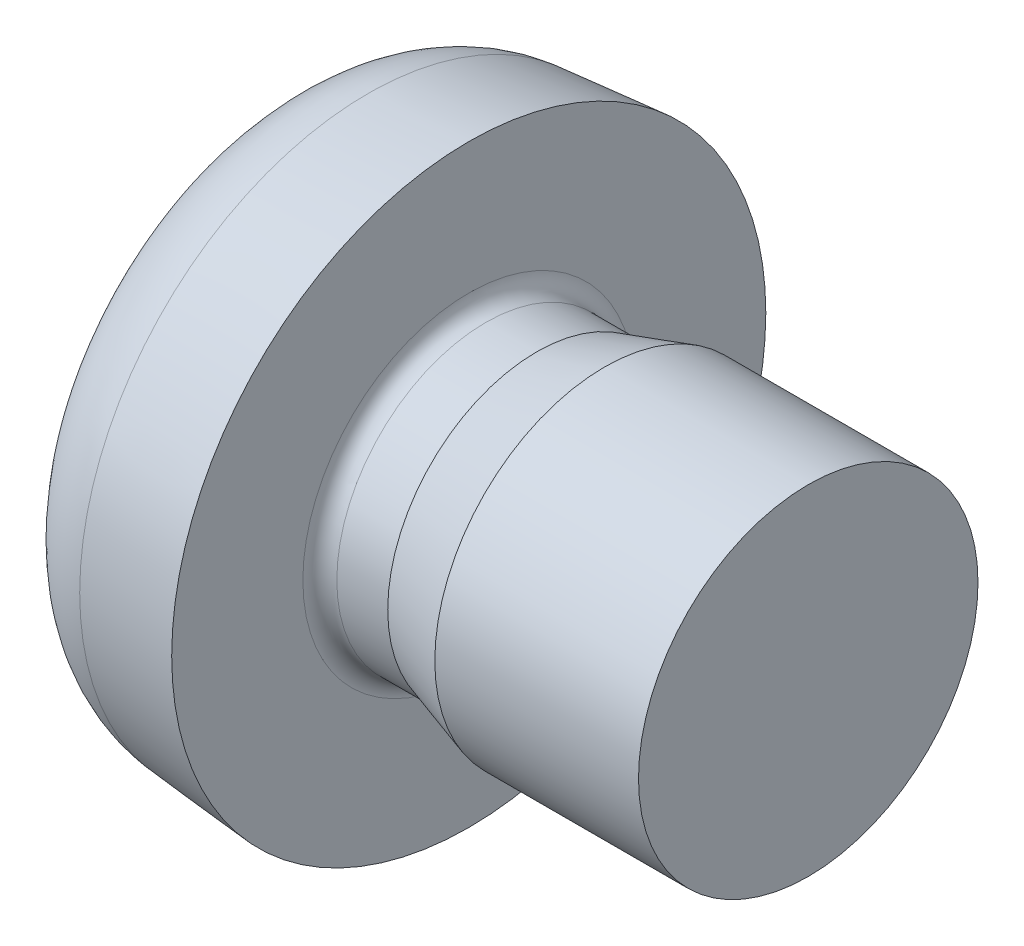
ISO-10303-21;
HEADER;
FILE_DESCRIPTION(('STEP AP214'),'2;1');
FILE_NAME('part.step','',(''),(''),'','','');
FILE_SCHEMA(('AUTOMOTIVE_DESIGN { 1 0 10303 214 1 1 1 1 }'));
ENDSEC;
DATA;
#1=APPLICATION_CONTEXT('core data for automotive mechanical design processes');
#2=APPLICATION_PROTOCOL_DEFINITION('international standard','automotive_design',2000,#1);
#3=PRODUCT_CONTEXT('',#1,'mechanical');
#4=PRODUCT('Part','Part','',(#3));
#5=PRODUCT_RELATED_PRODUCT_CATEGORY('part','',(#4));
#6=PRODUCT_DEFINITION_FORMATION('','',#4);
#7=PRODUCT_DEFINITION_CONTEXT('part definition',#1,'design');
#8=PRODUCT_DEFINITION('design','',#6,#7);
#9=PRODUCT_DEFINITION_SHAPE('','',#8);
#10=(LENGTH_UNIT() NAMED_UNIT(*) SI_UNIT(.MILLI.,.METRE.));
#11=(NAMED_UNIT(*) PLANE_ANGLE_UNIT() SI_UNIT($,.RADIAN.));
#12=(NAMED_UNIT(*) SI_UNIT($,.STERADIAN.) SOLID_ANGLE_UNIT());
#13=UNCERTAINTY_MEASURE_WITH_UNIT(LENGTH_MEASURE(1.E-05),#10,'distance_accuracy_value','');
#14=(GEOMETRIC_REPRESENTATION_CONTEXT(3) GLOBAL_UNCERTAINTY_ASSIGNED_CONTEXT((#13)) GLOBAL_UNIT_ASSIGNED_CONTEXT((#10,
#11,#12)) REPRESENTATION_CONTEXT('',''));
#15=CARTESIAN_POINT('',(0.,0.,0.));
#16=DIRECTION('',(0.,0.,1.));
#17=DIRECTION('',(1.,0.,0.));
#18=AXIS2_PLACEMENT_3D('',#15,#16,#17);
#19=CARTESIAN_POINT('',(3.19999999999697,5.00467722819309E-13,0.));
#20=DIRECTION('',(-1.,0.,0.));
#21=DIRECTION('',(0.,1.,0.));
#22=AXIS2_PLACEMENT_3D('',#19,#20,#21);
#23=SPHERICAL_SURFACE('',#22,4.49999999999697);
#24=CARTESIAN_POINT('',(-1.1171858241993,0.,0.));
#25=DIRECTION('',(-1.,0.,0.));
#26=DIRECTION('',(0.,0.,1.));
#27=AXIS2_PLACEMENT_3D('',#24,#25,#26);
#28=CIRCLE('',#27,1.2696088213827);
#29=CARTESIAN_POINT('',(-1.1171858241993,0.,1.2696088213827));
#30=VERTEX_POINT('',#29);
#31=EDGE_CURVE('E190',#30,#30,#28,.T.);
#32=ORIENTED_EDGE('',*,*,#31,.T.);
#33=EDGE_LOOP('',(#32));
#34=FACE_BOUND('',#33,.T.);
#35=CARTESIAN_POINT('',(3.19999999999697,0.23333333333333,0.));
#36=DIRECTION('',(0.,-1.,0.));
#37=DIRECTION('',(0.,0.,-1.));
#38=AXIS2_PLACEMENT_3D('',#35,#36,#37);
#39=CIRCLE('',#38,4.49394654569105);
#40=CARTESIAN_POINT('',(-1.15724173710329,0.23333333333333,1.1));
#41=VERTEX_POINT('',#40);
#42=CARTESIAN_POINT('',(-1.25592614141861,0.23333333333333,0.58333333333333));
#43=VERTEX_POINT('',#42);
#44=EDGE_CURVE('E11',#41,#43,#39,.T.);
#45=ORIENTED_EDGE('',*,*,#44,.F.);
#46=CARTESIAN_POINT('',(3.19999999999697,5.00467722819309E-13,1.1));
#47=DIRECTION('',(0.,0.,-1.));
#48=DIRECTION('',(-1.,0.,0.));
#49=AXIS2_PLACEMENT_3D('',#46,#47,#48);
#50=CIRCLE('',#49,4.36348484585116);
#51=CARTESIAN_POINT('',(-1.15724173710324,-0.23333333333333,1.1));
#52=VERTEX_POINT('',#51);
#53=EDGE_CURVE('E43',#52,#41,#50,.T.);
#54=ORIENTED_EDGE('',*,*,#53,.F.);
#55=CARTESIAN_POINT('',(3.19999999999697,-0.23333333333333,0.));
#56=DIRECTION('',(0.,1.,0.));
#57=DIRECTION('',(0.,0.,1.));
#58=AXIS2_PLACEMENT_3D('',#55,#56,#57);
#59=CIRCLE('',#58,4.493946545691);
#60=CARTESIAN_POINT('',(-1.25592614141856,-0.23333333333333,0.58333333333333));
#61=VERTEX_POINT('',#60);
#62=EDGE_CURVE('E280',#61,#52,#59,.T.);
#63=ORIENTED_EDGE('',*,*,#62,.F.);
#64=CARTESIAN_POINT('',(-1.25589995149991,-0.58353333333333,0.233333390476192));
#65=CARTESIAN_POINT('',(-1.2584496829755,-0.564084851912746,0.233305072197745));
#66=CARTESIAN_POINT('',(-1.26078445284113,-0.544607407145582,0.234931382302894));
#67=CARTESIAN_POINT('',(-1.26496625073796,-0.506146503499135,0.241398964079554));
#68=CARTESIAN_POINT('',(-1.26681343518266,-0.487162887969295,0.246239202992621));
#69=CARTESIAN_POINT('',(-1.26996529171344,-0.450212688779383,0.259045881137822));
#70=CARTESIAN_POINT('',(-1.27126950205385,-0.432246981919,0.267014970003607));
#71=CARTESIAN_POINT('',(-1.27329407444289,-0.397881531193257,0.285858513724991));
#72=CARTESIAN_POINT('',(-1.27401464252989,-0.381481236508637,0.296731941481725));
#73=CARTESIAN_POINT('',(-1.27484665055323,-0.350862649291144,0.320968649593749));
#74=CARTESIAN_POINT('',(-1.27496356304685,-0.336625892903947,0.334308420734499));
#75=CARTESIAN_POINT('',(-1.27459947008775,-0.310564264718913,0.363163023728163));
#76=CARTESIAN_POINT('',(-1.27411838158194,-0.298739728206596,0.378678157439715));
#77=CARTESIAN_POINT('',(-1.27257602168835,-0.277880461695409,0.411365142703991));
#78=CARTESIAN_POINT('',(-1.27151710548053,-0.268834638240971,0.428530037544093));
#79=CARTESIAN_POINT('',(-1.2688517446949,-0.253710468019218,0.464079307351874));
#80=CARTESIAN_POINT('',(-1.26724547437763,-0.247631178296108,0.48246329270062));
#81=CARTESIAN_POINT('',(-1.26405189501782,-0.239848703553279,0.514692452511942));
#82=CARTESIAN_POINT('',(-1.26258410818833,-0.237398051960483,0.528374369445237));
#83=CARTESIAN_POINT('',(-1.25941320700315,-0.234136171400748,0.555885468612324));
#84=CARTESIAN_POINT('',(-1.2577104299096,-0.233322618458616,0.569714414034388));
#85=CARTESIAN_POINT('',(-1.25589995149995,-0.233333390476192,0.58353333333333));
#86=B_SPLINE_CURVE_WITH_KNOTS('',3,(#64,#65,#66,#67,#68,#69,#70,#71,#72,#73,#74,#75,#76,#77,#78,
#79,#80,#81,#82,#83,#84,#85),.UNSPECIFIED.,.F.,.F.,(4,2,2,2,2,2,2,2,2,2,4),(0.,
0.0587752976278044,0.117531717635116,0.176338002592165,0.235123518594541,0.29337515540582,
0.351634883371351,0.409658903993778,0.467664468805511,0.509501117761438,0.55127833467374),.UNSPECIFIED.);
#87=CARTESIAN_POINT('',(-1.25592614141852,-0.58333333333333,0.23333333333333));
#88=VERTEX_POINT('',#87);
#89=EDGE_CURVE('E274',#88,#61,#86,.T.);
#90=ORIENTED_EDGE('',*,*,#89,.F.);
#91=CARTESIAN_POINT('',(3.19999999999697,5.00467722819309E-13,0.23333333333333));
#92=DIRECTION('',(0.,0.,-1.));
#93=DIRECTION('',(-1.,0.,0.));
#94=AXIS2_PLACEMENT_3D('',#91,#92,#93);
#95=CIRCLE('',#94,4.49394654569103);
#96=CARTESIAN_POINT('',(-1.15724173710314,-1.1,0.23333333333333));
#97=VERTEX_POINT('',#96);
#98=EDGE_CURVE('E281',#97,#88,#95,.T.);
#99=ORIENTED_EDGE('',*,*,#98,.F.);
#100=CARTESIAN_POINT('',(3.19999999999697,-1.1,0.));
#101=DIRECTION('',(0.,1.,0.));
#102=DIRECTION('',(0.,0.,1.));
#103=AXIS2_PLACEMENT_3D('',#100,#101,#102);
#104=CIRCLE('',#103,4.36348484585104);
#105=CARTESIAN_POINT('',(-1.15724173710314,-1.1,-0.23333333333333));
#106=VERTEX_POINT('',#105);
#107=EDGE_CURVE('E340',#106,#97,#104,.T.);
#108=ORIENTED_EDGE('',*,*,#107,.F.);
#109=CARTESIAN_POINT('',(3.19999999999697,5.00467722819309E-13,-0.23333333333333));
#110=DIRECTION('',(0.,0.,1.));
#111=DIRECTION('',(1.,0.,0.));
#112=AXIS2_PLACEMENT_3D('',#109,#110,#111);
#113=CIRCLE('',#112,4.49394654569103);
#114=CARTESIAN_POINT('',(-1.25592614141852,-0.58333333333333,-0.23333333333333));
#115=VERTEX_POINT('',#114);
#116=EDGE_CURVE('E245',#115,#106,#113,.T.);
#117=ORIENTED_EDGE('',*,*,#116,.F.);
#118=CARTESIAN_POINT('',(-1.25589995149995,-0.233333390476192,-0.58353333333333));
#119=CARTESIAN_POINT('',(-1.25844968297554,-0.233305072197745,-0.564084851912747));
#120=CARTESIAN_POINT('',(-1.26078445284116,-0.234931382302894,-0.544607407145583));
#121=CARTESIAN_POINT('',(-1.26496625073799,-0.241398964079553,-0.506146503499136));
#122=CARTESIAN_POINT('',(-1.26681343518268,-0.24623920299262,-0.487162887969297));
#123=CARTESIAN_POINT('',(-1.26996529171346,-0.259045881137821,-0.450212688779386));
#124=CARTESIAN_POINT('',(-1.27126950205387,-0.267014970003605,-0.432246981919004));
#125=CARTESIAN_POINT('',(-1.2732940744429,-0.285858513724989,-0.397881531193261));
#126=CARTESIAN_POINT('',(-1.2740146425299,-0.296731941481722,-0.381481236508641));
#127=CARTESIAN_POINT('',(-1.27484665055324,-0.320968649593745,-0.350862649291149));
#128=CARTESIAN_POINT('',(-1.27496356304685,-0.334308420734494,-0.336625892903952));
#129=CARTESIAN_POINT('',(-1.27459947008774,-0.363163023728157,-0.310564264718918));
#130=CARTESIAN_POINT('',(-1.27411838158193,-0.378678157439708,-0.298739728206601));
#131=CARTESIAN_POINT('',(-1.27257602168833,-0.411365142703983,-0.277880461695414));
#132=CARTESIAN_POINT('',(-1.27151710548051,-0.428530037544085,-0.268834638240975));
#133=CARTESIAN_POINT('',(-1.26885174469488,-0.464079307351865,-0.253710468019221));
#134=CARTESIAN_POINT('',(-1.2672454743776,-0.482463292700611,-0.247631178296111));
#135=CARTESIAN_POINT('',(-1.26405189501779,-0.514692452511934,-0.239848703553281));
#136=CARTESIAN_POINT('',(-1.2625841081883,-0.528374369445231,-0.237398051960483));
#137=CARTESIAN_POINT('',(-1.25941320700312,-0.555885468612321,-0.234136171400748));
#138=CARTESIAN_POINT('',(-1.25771042990956,-0.569714414034387,-0.233322618458616));
#139=CARTESIAN_POINT('',(-1.25589995149991,-0.58353333333333,-0.233333390476192));
#140=B_SPLINE_CURVE_WITH_KNOTS('',3,(#118,#119,#120,#121,#122,#123,#124,#125,#126,#127,#128,
#129,#130,#131,#132,#133,#134,#135,#136,#137,#138,#139),.UNSPECIFIED.,.F.,.F.,(4,2,2,2,2,2,2,2,
2,2,4),(0.,0.0587752976278023,0.117531717635112,0.176338002592159,0.235123518594533,
0.293375155405811,0.35163488337134,0.409658903993767,0.4676644688055,0.509501117761433,
0.55127833467374),.UNSPECIFIED.);
#141=CARTESIAN_POINT('',(-1.25592614141856,-0.23333333333333,-0.58333333333333));
#142=VERTEX_POINT('',#141);
#143=EDGE_CURVE('E239',#142,#115,#140,.T.);
#144=ORIENTED_EDGE('',*,*,#143,.F.);
#145=CARTESIAN_POINT('',(3.19999999999697,-0.23333333333333,0.));
#146=DIRECTION('',(0.,1.,0.));
#147=DIRECTION('',(0.,0.,1.));
#148=AXIS2_PLACEMENT_3D('',#145,#146,#147);
#149=CIRCLE('',#148,4.493946545691);
#150=CARTESIAN_POINT('',(-1.15724173710324,-0.23333333333333,-1.1));
#151=VERTEX_POINT('',#150);
#152=EDGE_CURVE('E237',#151,#142,#149,.T.);
#153=ORIENTED_EDGE('',*,*,#152,.F.);
#154=CARTESIAN_POINT('',(3.19999999999697,5.00467722819309E-13,-1.1));
#155=DIRECTION('',(0.,0.,1.));
#156=DIRECTION('',(1.,0.,0.));
#157=AXIS2_PLACEMENT_3D('',#154,#155,#156);
#158=CIRCLE('',#157,4.36348484585116);
#159=CARTESIAN_POINT('',(-1.15724173710329,0.23333333333333,-1.1));
#160=VERTEX_POINT('',#159);
#161=EDGE_CURVE('E235',#160,#151,#158,.T.);
#162=ORIENTED_EDGE('',*,*,#161,.F.);
#163=CARTESIAN_POINT('',(3.19999999999697,0.23333333333333,0.));
#164=DIRECTION('',(0.,-1.,0.));
#165=DIRECTION('',(0.,0.,-1.));
#166=AXIS2_PLACEMENT_3D('',#163,#164,#165);
#167=CIRCLE('',#166,4.49394654569105);
#168=CARTESIAN_POINT('',(-1.25592614141861,0.23333333333333,-0.58333333333333));
#169=VERTEX_POINT('',#168);
#170=EDGE_CURVE('E232',#169,#160,#167,.T.);
#171=ORIENTED_EDGE('',*,*,#170,.F.);
#172=CARTESIAN_POINT('',(-1.25589995150004,0.58353333333333,-0.233333390476192));
#173=CARTESIAN_POINT('',(-1.25844968297562,0.564084851912746,-0.233305072197745));
#174=CARTESIAN_POINT('',(-1.26078445284125,0.544607407145582,-0.234931382302894));
#175=CARTESIAN_POINT('',(-1.26496625073808,0.506146503499135,-0.241398964079554));
#176=CARTESIAN_POINT('',(-1.26681343518277,0.487162887969296,-0.246239202992621));
#177=CARTESIAN_POINT('',(-1.26996529171354,0.450212688779385,-0.259045881137821));
#178=CARTESIAN_POINT('',(-1.27126950205395,0.432246981919002,-0.267014970003606));
#179=CARTESIAN_POINT('',(-1.27329407444297,0.397881531193259,-0.28585851372499));
#180=CARTESIAN_POINT('',(-1.27401464252997,0.381481236508639,-0.296731941481723));
#181=CARTESIAN_POINT('',(-1.27484665055331,0.350862649291147,-0.320968649593747));
#182=CARTESIAN_POINT('',(-1.27496356304693,0.33662589290395,-0.334308420734496));
#183=CARTESIAN_POINT('',(-1.27459947008782,0.310564264718915,-0.36316302372816));
#184=CARTESIAN_POINT('',(-1.27411838158201,0.298739728206598,-0.378678157439712));
#185=CARTESIAN_POINT('',(-1.27257602168841,0.277880461695411,-0.411365142703988));
#186=CARTESIAN_POINT('',(-1.27151710548059,0.268834638240972,-0.42853003754409));
#187=CARTESIAN_POINT('',(-1.26885174469496,0.253710468019218,-0.464079307351872));
#188=CARTESIAN_POINT('',(-1.26724547437768,0.247631178296108,-0.482463292700618));
#189=CARTESIAN_POINT('',(-1.26405189501787,0.239848703553279,-0.514692452511941));
#190=CARTESIAN_POINT('',(-1.26258410818838,0.237398051960483,-0.528374369445236));
#191=CARTESIAN_POINT('',(-1.2594132070032,0.234136171400748,-0.555885468612324));
#192=CARTESIAN_POINT('',(-1.25771042990965,0.233322618458616,-0.569714414034388));
#193=CARTESIAN_POINT('',(-1.2558999515,0.233333390476192,-0.58353333333333));
#194=B_SPLINE_CURVE_WITH_KNOTS('',3,(#172,#173,#174,#175,#176,#177,#178,#179,#180,#181,#182,
#183,#184,#185,#186,#187,#188,#189,#190,#191,#192,#193),.UNSPECIFIED.,.F.,.F.,(4,2,2,2,2,2,2,2,
2,2,4),(0.,0.0587752976278027,0.117531717635112,0.17633800259216,0.235123518594534,
0.293375155405813,0.351634883371344,0.409658903993772,0.467664468805507,0.509501117761435,
0.551278334673738),.UNSPECIFIED.);
#195=CARTESIAN_POINT('',(-1.25592614141865,0.58333333333333,-0.23333333333333));
#196=VERTEX_POINT('',#195);
#197=EDGE_CURVE('E226',#196,#169,#194,.T.);
#198=ORIENTED_EDGE('',*,*,#197,.F.);
#199=CARTESIAN_POINT('',(3.19999999999697,5.00467722819309E-13,-0.23333333333333));
#200=DIRECTION('',(0.,0.,1.));
#201=DIRECTION('',(1.,0.,0.));
#202=AXIS2_PLACEMENT_3D('',#199,#200,#201);
#203=CIRCLE('',#202,4.49394654569103);
#204=CARTESIAN_POINT('',(-1.15724173710339,1.1,-0.23333333333333));
#205=VERTEX_POINT('',#204);
#206=EDGE_CURVE('E233',#205,#196,#203,.T.);
#207=ORIENTED_EDGE('',*,*,#206,.F.);
#208=CARTESIAN_POINT('',(3.19999999999697,1.1,0.));
#209=DIRECTION('',(0.,-1.,0.));
#210=DIRECTION('',(0.,0.,-1.));
#211=AXIS2_PLACEMENT_3D('',#208,#209,#210);
#212=CIRCLE('',#211,4.36348484585129);
#213=CARTESIAN_POINT('',(-1.15724173710339,1.1,0.23333333333333));
#214=VERTEX_POINT('',#213);
#215=EDGE_CURVE('E373',#214,#205,#212,.T.);
#216=ORIENTED_EDGE('',*,*,#215,.F.);
#217=CARTESIAN_POINT('',(3.19999999999697,5.00467722819309E-13,0.23333333333333));
#218=DIRECTION('',(0.,0.,-1.));
#219=DIRECTION('',(-1.,0.,0.));
#220=AXIS2_PLACEMENT_3D('',#217,#218,#219);
#221=CIRCLE('',#220,4.49394654569103);
#222=CARTESIAN_POINT('',(-1.25592614141865,0.58333333333333,0.23333333333333));
#223=VERTEX_POINT('',#222);
#224=EDGE_CURVE('E199',#223,#214,#221,.T.);
#225=ORIENTED_EDGE('',*,*,#224,.F.);
#226=CARTESIAN_POINT('',(-1.25589995150001,0.233333390476192,0.58353333333333));
#227=CARTESIAN_POINT('',(-1.25844968297559,0.233305072197745,0.564084851912746));
#228=CARTESIAN_POINT('',(-1.26078445284122,0.234931382302894,0.544607407145582));
#229=CARTESIAN_POINT('',(-1.26496625073805,0.241398964079554,0.506146503499134));
#230=CARTESIAN_POINT('',(-1.26681343518274,0.246239202992621,0.487162887969294));
#231=CARTESIAN_POINT('',(-1.26996529171352,0.259045881137823,0.450212688779382));
#232=CARTESIAN_POINT('',(-1.27126950205393,0.267014970003608,0.432246981918999));
#233=CARTESIAN_POINT('',(-1.27329407444296,0.285858513724992,0.397881531193255));
#234=CARTESIAN_POINT('',(-1.27401464252996,0.296731941481726,0.381481236508634));
#235=CARTESIAN_POINT('',(-1.27484665055331,0.320968649593751,0.350862649291142));
#236=CARTESIAN_POINT('',(-1.27496356304693,0.334308420734501,0.336625892903945));
#237=CARTESIAN_POINT('',(-1.27459947008782,0.363163023728167,0.31056426471891));
#238=CARTESIAN_POINT('',(-1.27411838158202,0.378678157439718,0.298739728206593));
#239=CARTESIAN_POINT('',(-1.27257602168843,0.411365142703996,0.277880461695407));
#240=CARTESIAN_POINT('',(-1.2715171054806,0.428530037544098,0.268834638240968));
#241=CARTESIAN_POINT('',(-1.26885174469498,0.464079307351881,0.253710468019215));
#242=CARTESIAN_POINT('',(-1.26724547437771,0.482463292700628,0.247631178296106));
#243=CARTESIAN_POINT('',(-1.2640518950179,0.51469245251195,0.239848703553278));
#244=CARTESIAN_POINT('',(-1.26258410818841,0.528374369445243,0.237398051960482));
#245=CARTESIAN_POINT('',(-1.25941320700324,0.555885468612327,0.234136171400748));
#246=CARTESIAN_POINT('',(-1.25771042990969,0.569714414034389,0.233322618458616));
#247=CARTESIAN_POINT('',(-1.25589995150004,0.58353333333333,0.233333390476192));
#248=B_SPLINE_CURVE_WITH_KNOTS('',3,(#226,#227,#228,#229,#230,#231,#232,#233,#234,#235,#236,
#237,#238,#239,#240,#241,#242,#243,#244,#245,#246,#247),.UNSPECIFIED.,.F.,.F.,(4,2,2,2,2,2,2,2,
2,2,4),(0.,0.0587752976278047,0.117531717635117,0.176338002592166,0.235123518594543,
0.293375155405823,0.351634883371355,0.409658903993783,0.467664468805518,0.50950111776144,
0.551278334673738),.UNSPECIFIED.);
#249=EDGE_CURVE('E193',#43,#223,#248,.T.);
#250=ORIENTED_EDGE('',*,*,#249,.F.);
#251=EDGE_LOOP('',(#45,#54,#63,#90,#99,#108,#117,#144,#153,#162,#171,#198,#207,#216,#225,#250));
#252=FACE_BOUND('',#251,.T.);
#253=ADVANCED_FACE('F35',(#34,#252),#23,.T.);
#254=CARTESIAN_POINT('',(-0.541561047639258,0.,0.));
#255=DIRECTION('',(-1.,0.,0.));
#256=DIRECTION('',(0.,0.,1.));
#257=AXIS2_PLACEMENT_3D('',#254,#255,#256);
#258=TOROIDAL_SURFACE('',#257,1.10032764519819,0.600000000000175);
#259=ORIENTED_EDGE('',*,*,#31,.F.);
#260=EDGE_LOOP('',(#259));
#261=FACE_BOUND('',#260,.T.);
#262=CARTESIAN_POINT('',(-0.59385449328798,0.,0.));
#263=DIRECTION('',(-1.,0.,0.));
#264=DIRECTION('',(0.,0.,1.));
#265=AXIS2_PLACEMENT_3D('',#262,#263,#264);
#266=CIRCLE('',#265,1.6980444640534);
#267=CARTESIAN_POINT('',(-0.59385449328798,0.,1.6980444640534));
#268=VERTEX_POINT('',#267);
#269=EDGE_CURVE('E187',#268,#268,#266,.T.);
#270=ORIENTED_EDGE('',*,*,#269,.T.);
#271=EDGE_LOOP('',(#270));
#272=FACE_BOUND('',#271,.T.);
#273=ADVANCED_FACE('F397',(#261,#272),#258,.T.);
#274=CARTESIAN_POINT('',(0.,0.,0.));
#275=DIRECTION('',(1.,0.,0.));
#276=DIRECTION('',(0.,0.,-1.));
#277=AXIS2_PLACEMENT_3D('',#274,#275,#276);
#278=CONICAL_SURFACE('',#277,1.75,0.0872664625996661);
#279=ORIENTED_EDGE('',*,*,#269,.F.);
#280=EDGE_LOOP('',(#279));
#281=FACE_BOUND('',#280,.T.);
#282=CARTESIAN_POINT('',(0.,0.,0.));
#283=DIRECTION('',(-1.,0.,0.));
#284=DIRECTION('',(0.,0.,1.));
#285=AXIS2_PLACEMENT_3D('',#282,#283,#284);
#286=CIRCLE('',#285,1.75);
#287=CARTESIAN_POINT('',(0.,0.,1.75));
#288=VERTEX_POINT('',#287);
#289=EDGE_CURVE('E184',#288,#288,#286,.T.);
#290=ORIENTED_EDGE('',*,*,#289,.T.);
#291=EDGE_LOOP('',(#290));
#292=FACE_BOUND('',#291,.T.);
#293=ADVANCED_FACE('F402',(#281,#292),#278,.T.);
#294=CARTESIAN_POINT('',(0.,1.75,0.));
#295=DIRECTION('',(-1.,0.,0.));
#296=DIRECTION('',(0.,0.,1.));
#297=AXIS2_PLACEMENT_3D('',#294,#295,#296);
#298=PLANE('',#297);
#299=ORIENTED_EDGE('',*,*,#289,.F.);
#300=EDGE_LOOP('',(#299));
#301=FACE_BOUND('',#300,.T.);
#302=CARTESIAN_POINT('',(0.,0.,0.));
#303=DIRECTION('',(-1.,0.,0.));
#304=DIRECTION('',(0.,0.,1.));
#305=AXIS2_PLACEMENT_3D('',#302,#303,#304);
#306=CIRCLE('',#305,0.97725000000002);
#307=CARTESIAN_POINT('',(0.,0.,0.97725000000002));
#308=VERTEX_POINT('',#307);
#309=EDGE_CURVE('E181',#308,#308,#306,.T.);
#310=ORIENTED_EDGE('',*,*,#309,.T.);
#311=EDGE_LOOP('',(#310));
#312=FACE_BOUND('',#311,.T.);
#313=ADVANCED_FACE('F410',(#301,#312),#298,.F.);
#314=CARTESIAN_POINT('',(0.0999999999999906,0.,0.));
#315=DIRECTION('',(-1.,0.,0.));
#316=DIRECTION('',(0.,0.,1.));
#317=AXIS2_PLACEMENT_3D('',#314,#315,#316);
#318=TOROIDAL_SURFACE('',#317,0.977250000000011,0.0999999999999906);
#319=ORIENTED_EDGE('',*,*,#309,.F.);
#320=EDGE_LOOP('',(#319));
#321=FACE_BOUND('',#320,.T.);
#322=CARTESIAN_POINT('',(0.0999999999999981,0.,0.));
#323=DIRECTION('',(-1.,0.,0.));
#324=DIRECTION('',(0.,0.,1.));
#325=AXIS2_PLACEMENT_3D('',#322,#323,#324);
#326=CIRCLE('',#325,0.87725000000002);
#327=CARTESIAN_POINT('',(0.0999999999999981,0.,0.87725000000002));
#328=VERTEX_POINT('',#327);
#329=EDGE_CURVE('E178',#328,#328,#326,.T.);
#330=ORIENTED_EDGE('',*,*,#329,.T.);
#331=EDGE_LOOP('',(#330));
#332=FACE_BOUND('',#331,.T.);
#333=ADVANCED_FACE('F416',(#321,#332),#318,.F.);
#334=CARTESIAN_POINT('',(2.,0.,0.));
#335=DIRECTION('',(-1.,0.,0.));
#336=DIRECTION('',(0.,0.,1.));
#337=AXIS2_PLACEMENT_3D('',#334,#335,#336);
#338=CYLINDRICAL_SURFACE('',#337,0.877250000000015);
#339=ORIENTED_EDGE('',*,*,#329,.F.);
#340=EDGE_LOOP('',(#339));
#341=FACE_BOUND('',#340,.T.);
#342=CARTESIAN_POINT('',(0.40000000000002,0.,0.));
#343=DIRECTION('',(-1.,0.,0.));
#344=DIRECTION('',(0.,0.,1.));
#345=AXIS2_PLACEMENT_3D('',#342,#343,#344);
#346=CIRCLE('',#345,0.87725000000001);
#347=CARTESIAN_POINT('',(0.40000000000002,0.,0.87725000000001));
#348=VERTEX_POINT('',#347);
#349=EDGE_CURVE('E175',#348,#348,#346,.T.);
#350=ORIENTED_EDGE('',*,*,#349,.T.);
#351=EDGE_LOOP('',(#350));
#352=FACE_BOUND('',#351,.T.);
#353=ADVANCED_FACE('F422',(#341,#352),#338,.T.);
#354=CARTESIAN_POINT('',(0.8,0.,0.));
#355=DIRECTION('',(1.,0.,0.));
#356=DIRECTION('',(0.,0.,-1.));
#357=AXIS2_PLACEMENT_3D('',#354,#355,#356);
#358=CONICAL_SURFACE('',#357,1.,0.297752138542782);
#359=ORIENTED_EDGE('',*,*,#349,.F.);
#360=EDGE_LOOP('',(#359));
#361=FACE_BOUND('',#360,.T.);
#362=CARTESIAN_POINT('',(0.8,0.,0.));
#363=DIRECTION('',(-1.,0.,0.));
#364=DIRECTION('',(0.,0.,1.));
#365=AXIS2_PLACEMENT_3D('',#362,#363,#364);
#366=CIRCLE('',#365,1.);
#367=CARTESIAN_POINT('',(0.8,0.,1.));
#368=VERTEX_POINT('',#367);
#369=EDGE_CURVE('E167',#368,#368,#366,.T.);
#370=ORIENTED_EDGE('',*,*,#369,.T.);
#371=EDGE_LOOP('',(#370));
#372=FACE_BOUND('',#371,.T.);
#373=ADVANCED_FACE('F428',(#361,#372),#358,.T.);
#374=CARTESIAN_POINT('',(2.,0.,0.));
#375=DIRECTION('',(-1.,0.,0.));
#376=DIRECTION('',(0.,0.,1.));
#377=AXIS2_PLACEMENT_3D('',#374,#375,#376);
#378=CYLINDRICAL_SURFACE('',#377,1.);
#379=ORIENTED_EDGE('',*,*,#369,.F.);
#380=EDGE_LOOP('',(#379));
#381=FACE_BOUND('',#380,.T.);
#382=CARTESIAN_POINT('',(2.,0.,0.));
#383=DIRECTION('',(-1.,0.,0.));
#384=DIRECTION('',(0.,0.,1.));
#385=AXIS2_PLACEMENT_3D('',#382,#383,#384);
#386=CIRCLE('',#385,1.);
#387=CARTESIAN_POINT('',(2.,0.,1.));
#388=VERTEX_POINT('',#387);
#389=EDGE_CURVE('E163',#388,#388,#386,.T.);
#390=ORIENTED_EDGE('',*,*,#389,.T.);
#391=EDGE_LOOP('',(#390));
#392=FACE_BOUND('',#391,.T.);
#393=ADVANCED_FACE('F434',(#381,#392),#378,.T.);
#394=CARTESIAN_POINT('',(2.,1.,0.));
#395=DIRECTION('',(-1.,0.,0.));
#396=DIRECTION('',(0.,0.,1.));
#397=AXIS2_PLACEMENT_3D('',#394,#395,#396);
#398=PLANE('',#397);
#399=ORIENTED_EDGE('',*,*,#389,.F.);
#400=EDGE_LOOP('',(#399));
#401=FACE_BOUND('',#400,.T.);
#402=ADVANCED_FACE('F440',(#401),#398,.F.);
#403=CARTESIAN_POINT('',(-0.65,0.23333333333333,0.58333333333333));
#404=DIRECTION('',(0.,-1.,0.));
#405=DIRECTION('',(0.,0.,-1.));
#406=AXIS2_PLACEMENT_3D('',#403,#404,#405);
#407=PLANE('',#406);
#408=ORIENTED_EDGE('',*,*,#44,.T.);
#409=DIRECTION('',(-1.,0.,0.));
#410=VECTOR('',#409,1.);
#411=CARTESIAN_POINT('',(-0.65,0.23333333333333,0.58333333333333));
#412=LINE('',#411,#410);
#413=CARTESIAN_POINT('',(-0.65,0.23333333333333,0.58333333333333));
#414=VERTEX_POINT('',#413);
#415=EDGE_CURVE('E50',#414,#43,#412,.T.);
#416=ORIENTED_EDGE('',*,*,#415,.F.);
#417=DIRECTION('',(0.,0.,1.));
#418=VECTOR('',#417,1.);
#419=CARTESIAN_POINT('',(-0.65,0.23333333333333,0.58333333333333));
#420=LINE('',#419,#418);
#421=CARTESIAN_POINT('',(-0.65,0.23333333333333,1.1));
#422=VERTEX_POINT('',#421);
#423=EDGE_CURVE('E152',#414,#422,#420,.T.);
#424=ORIENTED_EDGE('',*,*,#423,.T.);
#425=DIRECTION('',(-1.,0.,0.));
#426=VECTOR('',#425,1.);
#427=CARTESIAN_POINT('',(-0.65,0.23333333333333,1.1));
#428=LINE('',#427,#426);
#429=EDGE_CURVE('E159',#422,#41,#428,.T.);
#430=ORIENTED_EDGE('',*,*,#429,.T.);
#431=EDGE_LOOP('',(#408,#416,#424,#430));
#432=FACE_BOUND('',#431,.T.);
#433=ADVANCED_FACE('F158',(#432),#407,.T.);
#434=CARTESIAN_POINT('',(-0.65,0.23333333333333,1.1));
#435=DIRECTION('',(0.,0.,-1.));
#436=DIRECTION('',(-1.,0.,0.));
#437=AXIS2_PLACEMENT_3D('',#434,#435,#436);
#438=PLANE('',#437);
#439=ORIENTED_EDGE('',*,*,#53,.T.);
#440=ORIENTED_EDGE('',*,*,#429,.F.);
#441=DIRECTION('',(0.,-1.,0.));
#442=VECTOR('',#441,1.);
#443=CARTESIAN_POINT('',(-0.65,0.23333333333333,1.1));
#444=LINE('',#443,#442);
#445=CARTESIAN_POINT('',(-0.65,-0.23333333333333,1.1));
#446=VERTEX_POINT('',#445);
#447=EDGE_CURVE('E148',#422,#446,#444,.T.);
#448=ORIENTED_EDGE('',*,*,#447,.T.);
#449=DIRECTION('',(-1.,0.,0.));
#450=VECTOR('',#449,1.);
#451=CARTESIAN_POINT('',(-0.65,-0.23333333333333,1.1));
#452=LINE('',#451,#450);
#453=EDGE_CURVE('E164',#446,#52,#452,.T.);
#454=ORIENTED_EDGE('',*,*,#453,.T.);
#455=EDGE_LOOP('',(#439,#440,#448,#454));
#456=FACE_BOUND('',#455,.T.);
#457=ADVANCED_FACE('F162',(#456),#438,.T.);
#458=CARTESIAN_POINT('',(-0.65,-0.23333333333333,1.1));
#459=DIRECTION('',(0.,1.,0.));
#460=DIRECTION('',(0.,0.,1.));
#461=AXIS2_PLACEMENT_3D('',#458,#459,#460);
#462=PLANE('',#461);
#463=ORIENTED_EDGE('',*,*,#62,.T.);
#464=ORIENTED_EDGE('',*,*,#453,.F.);
#465=DIRECTION('',(0.,0.,-1.));
#466=VECTOR('',#465,1.);
#467=CARTESIAN_POINT('',(-0.65,-0.23333333333333,1.1));
#468=LINE('',#467,#466);
#469=CARTESIAN_POINT('',(-0.65,-0.23333333333333,0.58333333333333));
#470=VERTEX_POINT('',#469);
#471=EDGE_CURVE('E154',#446,#470,#468,.T.);
#472=ORIENTED_EDGE('',*,*,#471,.T.);
#473=DIRECTION('',(-1.,0.,0.));
#474=VECTOR('',#473,1.);
#475=CARTESIAN_POINT('',(-0.65,-0.23333333333333,0.58333333333333));
#476=LINE('',#475,#474);
#477=EDGE_CURVE('E169',#470,#61,#476,.T.);
#478=ORIENTED_EDGE('',*,*,#477,.T.);
#479=EDGE_LOOP('',(#463,#464,#472,#478));
#480=FACE_BOUND('',#479,.T.);
#481=ADVANCED_FACE('F270',(#480),#462,.T.);
#482=CARTESIAN_POINT('',(-0.65,-0.583333333333336,0.583333333333336));
#483=DIRECTION('',(-1.,0.,0.));
#484=DIRECTION('',(0.,0.,1.));
#485=AXIS2_PLACEMENT_3D('',#482,#483,#484);
#486=CYLINDRICAL_SURFACE('',#485,0.350000000000006);
#487=ORIENTED_EDGE('',*,*,#89,.T.);
#488=ORIENTED_EDGE('',*,*,#477,.F.);
#489=CARTESIAN_POINT('',(-0.65,-0.583333333333336,0.583333333333336));
#490=DIRECTION('',(-1.,0.,0.));
#491=DIRECTION('',(0.,0.,1.));
#492=AXIS2_PLACEMENT_3D('',#489,#490,#491);
#493=CIRCLE('',#492,0.350000000000006);
#494=CARTESIAN_POINT('',(-0.65,-0.58333333333333,0.23333333333333));
#495=VERTEX_POINT('',#494);
#496=EDGE_CURVE('E335',#470,#495,#493,.T.);
#497=ORIENTED_EDGE('',*,*,#496,.T.);
#498=DIRECTION('',(-1.,0.,0.));
#499=VECTOR('',#498,1.);
#500=CARTESIAN_POINT('',(-0.65,-0.58333333333333,0.23333333333333));
#501=LINE('',#500,#499);
#502=EDGE_CURVE('E332',#495,#88,#501,.T.);
#503=ORIENTED_EDGE('',*,*,#502,.T.);
#504=EDGE_LOOP('',(#487,#488,#497,#503));
#505=FACE_BOUND('',#504,.T.);
#506=ADVANCED_FACE('F265',(#505),#486,.T.);
#507=CARTESIAN_POINT('',(-0.65,-0.58333333333333,0.23333333333333));
#508=DIRECTION('',(0.,0.,-1.));
#509=DIRECTION('',(-1.,0.,0.));
#510=AXIS2_PLACEMENT_3D('',#507,#508,#509);
#511=PLANE('',#510);
#512=ORIENTED_EDGE('',*,*,#98,.T.);
#513=ORIENTED_EDGE('',*,*,#502,.F.);
#514=DIRECTION('',(0.,-1.,0.));
#515=VECTOR('',#514,1.);
#516=CARTESIAN_POINT('',(-0.65,-0.58333333333333,0.23333333333333));
#517=LINE('',#516,#515);
#518=CARTESIAN_POINT('',(-0.65,-1.1,0.23333333333333));
#519=VERTEX_POINT('',#518);
#520=EDGE_CURVE('E349',#495,#519,#517,.T.);
#521=ORIENTED_EDGE('',*,*,#520,.T.);
#522=DIRECTION('',(-1.,0.,0.));
#523=VECTOR('',#522,1.);
#524=CARTESIAN_POINT('',(-0.65,-1.1,0.23333333333333));
#525=LINE('',#524,#523);
#526=EDGE_CURVE('E329',#519,#97,#525,.T.);
#527=ORIENTED_EDGE('',*,*,#526,.T.);
#528=EDGE_LOOP('',(#512,#513,#521,#527));
#529=FACE_BOUND('',#528,.T.);
#530=ADVANCED_FACE('F261',(#529),#511,.T.);
#531=CARTESIAN_POINT('',(-0.65,-1.1,0.23333333333333));
#532=DIRECTION('',(0.,1.,0.));
#533=DIRECTION('',(0.,0.,1.));
#534=AXIS2_PLACEMENT_3D('',#531,#532,#533);
#535=PLANE('',#534);
#536=ORIENTED_EDGE('',*,*,#107,.T.);
#537=ORIENTED_EDGE('',*,*,#526,.F.);
#538=DIRECTION('',(0.,0.,-1.));
#539=VECTOR('',#538,1.);
#540=CARTESIAN_POINT('',(-0.65,-1.1,0.23333333333333));
#541=LINE('',#540,#539);
#542=CARTESIAN_POINT('',(-0.65,-1.1,-0.23333333333333));
#543=VERTEX_POINT('',#542);
#544=EDGE_CURVE('E347',#519,#543,#541,.T.);
#545=ORIENTED_EDGE('',*,*,#544,.T.);
#546=DIRECTION('',(-1.,0.,0.));
#547=VECTOR('',#546,1.);
#548=CARTESIAN_POINT('',(-0.65,-1.1,-0.23333333333333));
#549=LINE('',#548,#547);
#550=EDGE_CURVE('E326',#543,#106,#549,.T.);
#551=ORIENTED_EDGE('',*,*,#550,.T.);
#552=EDGE_LOOP('',(#536,#537,#545,#551));
#553=FACE_BOUND('',#552,.T.);
#554=ADVANCED_FACE('F257',(#553),#535,.T.);
#555=CARTESIAN_POINT('',(-0.65,-1.1,-0.23333333333333));
#556=DIRECTION('',(0.,0.,1.));
#557=DIRECTION('',(1.,0.,0.));
#558=AXIS2_PLACEMENT_3D('',#555,#556,#557);
#559=PLANE('',#558);
#560=ORIENTED_EDGE('',*,*,#116,.T.);
#561=ORIENTED_EDGE('',*,*,#550,.F.);
#562=DIRECTION('',(0.,1.,0.));
#563=VECTOR('',#562,1.);
#564=CARTESIAN_POINT('',(-0.65,-1.1,-0.23333333333333));
#565=LINE('',#564,#563);
#566=CARTESIAN_POINT('',(-0.65,-0.58333333333333,-0.23333333333333));
#567=VERTEX_POINT('',#566);
#568=EDGE_CURVE('E348',#543,#567,#565,.T.);
#569=ORIENTED_EDGE('',*,*,#568,.T.);
#570=DIRECTION('',(-1.,0.,0.));
#571=VECTOR('',#570,1.);
#572=CARTESIAN_POINT('',(-0.65,-0.58333333333333,-0.23333333333333));
#573=LINE('',#572,#571);
#574=EDGE_CURVE('E323',#567,#115,#573,.T.);
#575=ORIENTED_EDGE('',*,*,#574,.T.);
#576=EDGE_LOOP('',(#560,#561,#569,#575));
#577=FACE_BOUND('',#576,.T.);
#578=ADVANCED_FACE('F253',(#577),#559,.T.);
#579=CARTESIAN_POINT('',(-0.65,-0.583333333333336,-0.583333333333336));
#580=DIRECTION('',(-1.,0.,0.));
#581=DIRECTION('',(0.,0.,1.));
#582=AXIS2_PLACEMENT_3D('',#579,#580,#581);
#583=CYLINDRICAL_SURFACE('',#582,0.350000000000006);
#584=ORIENTED_EDGE('',*,*,#143,.T.);
#585=ORIENTED_EDGE('',*,*,#574,.F.);
#586=CARTESIAN_POINT('',(-0.65,-0.583333333333336,-0.583333333333336));
#587=DIRECTION('',(-1.,0.,0.));
#588=DIRECTION('',(0.,0.,1.));
#589=AXIS2_PLACEMENT_3D('',#586,#587,#588);
#590=CIRCLE('',#589,0.350000000000006);
#591=CARTESIAN_POINT('',(-0.65,-0.23333333333333,-0.58333333333333));
#592=VERTEX_POINT('',#591);
#593=EDGE_CURVE('E351',#567,#592,#590,.T.);
#594=ORIENTED_EDGE('',*,*,#593,.T.);
#595=DIRECTION('',(-1.,0.,0.));
#596=VECTOR('',#595,1.);
#597=CARTESIAN_POINT('',(-0.65,-0.23333333333333,-0.58333333333333));
#598=LINE('',#597,#596);
#599=EDGE_CURVE('E320',#592,#142,#598,.T.);
#600=ORIENTED_EDGE('',*,*,#599,.T.);
#601=EDGE_LOOP('',(#584,#585,#594,#600));
#602=FACE_BOUND('',#601,.T.);
#603=ADVANCED_FACE('F247',(#602),#583,.T.);
#604=CARTESIAN_POINT('',(-0.65,-0.23333333333333,-0.58333333333333));
#605=DIRECTION('',(0.,1.,0.));
#606=DIRECTION('',(0.,0.,1.));
#607=AXIS2_PLACEMENT_3D('',#604,#605,#606);
#608=PLANE('',#607);
#609=ORIENTED_EDGE('',*,*,#152,.T.);
#610=ORIENTED_EDGE('',*,*,#599,.F.);
#611=DIRECTION('',(0.,0.,-1.));
#612=VECTOR('',#611,1.);
#613=CARTESIAN_POINT('',(-0.65,-0.23333333333333,-0.58333333333333));
#614=LINE('',#613,#612);
#615=CARTESIAN_POINT('',(-0.65,-0.23333333333333,-1.1));
#616=VERTEX_POINT('',#615);
#617=EDGE_CURVE('E357',#592,#616,#614,.T.);
#618=ORIENTED_EDGE('',*,*,#617,.T.);
#619=DIRECTION('',(-1.,0.,0.));
#620=VECTOR('',#619,1.);
#621=CARTESIAN_POINT('',(-0.65,-0.23333333333333,-1.1));
#622=LINE('',#621,#620);
#623=EDGE_CURVE('E317',#616,#151,#622,.T.);
#624=ORIENTED_EDGE('',*,*,#623,.T.);
#625=EDGE_LOOP('',(#609,#610,#618,#624));
#626=FACE_BOUND('',#625,.T.);
#627=ADVANCED_FACE('F252',(#626),#608,.T.);
#628=CARTESIAN_POINT('',(-0.65,-0.23333333333333,-1.1));
#629=DIRECTION('',(0.,0.,1.));
#630=DIRECTION('',(1.,0.,0.));
#631=AXIS2_PLACEMENT_3D('',#628,#629,#630);
#632=PLANE('',#631);
#633=ORIENTED_EDGE('',*,*,#161,.T.);
#634=ORIENTED_EDGE('',*,*,#623,.F.);
#635=DIRECTION('',(0.,1.,0.));
#636=VECTOR('',#635,1.);
#637=CARTESIAN_POINT('',(-0.65,-0.23333333333333,-1.1));
#638=LINE('',#637,#636);
#639=CARTESIAN_POINT('',(-0.65,0.23333333333333,-1.1));
#640=VERTEX_POINT('',#639);
#641=EDGE_CURVE('E359',#616,#640,#638,.T.);
#642=ORIENTED_EDGE('',*,*,#641,.T.);
#643=DIRECTION('',(-1.,0.,0.));
#644=VECTOR('',#643,1.);
#645=CARTESIAN_POINT('',(-0.65,0.23333333333333,-1.1));
#646=LINE('',#645,#644);
#647=EDGE_CURVE('E314',#640,#160,#646,.T.);
#648=ORIENTED_EDGE('',*,*,#647,.T.);
#649=EDGE_LOOP('',(#633,#634,#642,#648));
#650=FACE_BOUND('',#649,.T.);
#651=ADVANCED_FACE('F388',(#650),#632,.T.);
#652=CARTESIAN_POINT('',(-0.65,0.23333333333333,-1.1));
#653=DIRECTION('',(0.,-1.,0.));
#654=DIRECTION('',(0.,0.,-1.));
#655=AXIS2_PLACEMENT_3D('',#652,#653,#654);
#656=PLANE('',#655);
#657=ORIENTED_EDGE('',*,*,#170,.T.);
#658=ORIENTED_EDGE('',*,*,#647,.F.);
#659=DIRECTION('',(0.,0.,1.));
#660=VECTOR('',#659,1.);
#661=CARTESIAN_POINT('',(-0.65,0.23333333333333,-1.1));
#662=LINE('',#661,#660);
#663=CARTESIAN_POINT('',(-0.65,0.23333333333333,-0.58333333333333));
#664=VERTEX_POINT('',#663);
#665=EDGE_CURVE('E361',#640,#664,#662,.T.);
#666=ORIENTED_EDGE('',*,*,#665,.T.);
#667=DIRECTION('',(-1.,0.,0.));
#668=VECTOR('',#667,1.);
#669=CARTESIAN_POINT('',(-0.65,0.23333333333333,-0.58333333333333));
#670=LINE('',#669,#668);
#671=EDGE_CURVE('E311',#664,#169,#670,.T.);
#672=ORIENTED_EDGE('',*,*,#671,.T.);
#673=EDGE_LOOP('',(#657,#658,#666,#672));
#674=FACE_BOUND('',#673,.T.);
#675=ADVANCED_FACE('F222',(#674),#656,.T.);
#676=CARTESIAN_POINT('',(-0.65,0.583333333333336,-0.583333333333336));
#677=DIRECTION('',(-1.,0.,0.));
#678=DIRECTION('',(0.,0.,1.));
#679=AXIS2_PLACEMENT_3D('',#676,#677,#678);
#680=CYLINDRICAL_SURFACE('',#679,0.350000000000006);
#681=ORIENTED_EDGE('',*,*,#197,.T.);
#682=ORIENTED_EDGE('',*,*,#671,.F.);
#683=CARTESIAN_POINT('',(-0.65,0.583333333333336,-0.583333333333336));
#684=DIRECTION('',(-1.,0.,0.));
#685=DIRECTION('',(0.,0.,1.));
#686=AXIS2_PLACEMENT_3D('',#683,#684,#685);
#687=CIRCLE('',#686,0.350000000000006);
#688=CARTESIAN_POINT('',(-0.65,0.58333333333333,-0.23333333333333));
#689=VERTEX_POINT('',#688);
#690=EDGE_CURVE('E363',#664,#689,#687,.T.);
#691=ORIENTED_EDGE('',*,*,#690,.T.);
#692=DIRECTION('',(-1.,0.,0.));
#693=VECTOR('',#692,1.);
#694=CARTESIAN_POINT('',(-0.65,0.58333333333333,-0.23333333333333));
#695=LINE('',#694,#693);
#696=EDGE_CURVE('E308',#689,#196,#695,.T.);
#697=ORIENTED_EDGE('',*,*,#696,.T.);
#698=EDGE_LOOP('',(#681,#682,#691,#697));
#699=FACE_BOUND('',#698,.T.);
#700=ADVANCED_FACE('F217',(#699),#680,.T.);
#701=CARTESIAN_POINT('',(-0.65,0.58333333333333,-0.23333333333333));
#702=DIRECTION('',(0.,0.,1.));
#703=DIRECTION('',(1.,0.,0.));
#704=AXIS2_PLACEMENT_3D('',#701,#702,#703);
#705=PLANE('',#704);
#706=ORIENTED_EDGE('',*,*,#206,.T.);
#707=ORIENTED_EDGE('',*,*,#696,.F.);
#708=DIRECTION('',(0.,1.,0.));
#709=VECTOR('',#708,1.);
#710=CARTESIAN_POINT('',(-0.65,0.58333333333333,-0.23333333333333));
#711=LINE('',#710,#709);
#712=CARTESIAN_POINT('',(-0.65,1.1,-0.23333333333333));
#713=VERTEX_POINT('',#712);
#714=EDGE_CURVE('E365',#689,#713,#711,.T.);
#715=ORIENTED_EDGE('',*,*,#714,.T.);
#716=DIRECTION('',(-1.,0.,0.));
#717=VECTOR('',#716,1.);
#718=CARTESIAN_POINT('',(-0.65,1.1,-0.23333333333333));
#719=LINE('',#718,#717);
#720=EDGE_CURVE('E300',#713,#205,#719,.T.);
#721=ORIENTED_EDGE('',*,*,#720,.T.);
#722=EDGE_LOOP('',(#706,#707,#715,#721));
#723=FACE_BOUND('',#722,.T.);
#724=ADVANCED_FACE('F213',(#723),#705,.T.);
#725=CARTESIAN_POINT('',(-0.65,1.1,-0.23333333333333));
#726=DIRECTION('',(0.,-1.,0.));
#727=DIRECTION('',(0.,0.,-1.));
#728=AXIS2_PLACEMENT_3D('',#725,#726,#727);
#729=PLANE('',#728);
#730=ORIENTED_EDGE('',*,*,#215,.T.);
#731=ORIENTED_EDGE('',*,*,#720,.F.);
#732=DIRECTION('',(0.,0.,1.));
#733=VECTOR('',#732,1.);
#734=CARTESIAN_POINT('',(-0.65,1.1,-0.23333333333333));
#735=LINE('',#734,#733);
#736=CARTESIAN_POINT('',(-0.65,1.1,0.23333333333333));
#737=VERTEX_POINT('',#736);
#738=EDGE_CURVE('E367',#713,#737,#735,.T.);
#739=ORIENTED_EDGE('',*,*,#738,.T.);
#740=DIRECTION('',(-1.,0.,0.));
#741=VECTOR('',#740,1.);
#742=CARTESIAN_POINT('',(-0.65,1.1,0.23333333333333));
#743=LINE('',#742,#741);
#744=EDGE_CURVE('E298',#737,#214,#743,.T.);
#745=ORIENTED_EDGE('',*,*,#744,.T.);
#746=EDGE_LOOP('',(#730,#731,#739,#745));
#747=FACE_BOUND('',#746,.T.);
#748=ADVANCED_FACE('F209',(#747),#729,.T.);
#749=CARTESIAN_POINT('',(-0.65,1.1,0.23333333333333));
#750=DIRECTION('',(0.,0.,-1.));
#751=DIRECTION('',(-1.,0.,0.));
#752=AXIS2_PLACEMENT_3D('',#749,#750,#751);
#753=PLANE('',#752);
#754=ORIENTED_EDGE('',*,*,#224,.T.);
#755=ORIENTED_EDGE('',*,*,#744,.F.);
#756=DIRECTION('',(0.,-1.,0.));
#757=VECTOR('',#756,1.);
#758=CARTESIAN_POINT('',(-0.65,1.1,0.23333333333333));
#759=LINE('',#758,#757);
#760=CARTESIAN_POINT('',(-0.65,0.58333333333333,0.23333333333333));
#761=VERTEX_POINT('',#760);
#762=EDGE_CURVE('E297',#737,#761,#759,.T.);
#763=ORIENTED_EDGE('',*,*,#762,.T.);
#764=DIRECTION('',(-1.,0.,0.));
#765=VECTOR('',#764,1.);
#766=CARTESIAN_POINT('',(-0.65,0.58333333333333,0.23333333333333));
#767=LINE('',#766,#765);
#768=EDGE_CURVE('E293',#761,#223,#767,.T.);
#769=ORIENTED_EDGE('',*,*,#768,.T.);
#770=EDGE_LOOP('',(#754,#755,#763,#769));
#771=FACE_BOUND('',#770,.T.);
#772=ADVANCED_FACE('F206',(#771),#753,.T.);
#773=CARTESIAN_POINT('',(-0.65,0.583333333333336,0.583333333333336));
#774=DIRECTION('',(-1.,0.,0.));
#775=DIRECTION('',(0.,0.,1.));
#776=AXIS2_PLACEMENT_3D('',#773,#774,#775);
#777=CYLINDRICAL_SURFACE('',#776,0.350000000000006);
#778=ORIENTED_EDGE('',*,*,#249,.T.);
#779=ORIENTED_EDGE('',*,*,#768,.F.);
#780=CARTESIAN_POINT('',(-0.65,0.583333333333336,0.583333333333336));
#781=DIRECTION('',(-1.,0.,0.));
#782=DIRECTION('',(0.,0.,1.));
#783=AXIS2_PLACEMENT_3D('',#780,#781,#782);
#784=CIRCLE('',#783,0.350000000000006);
#785=EDGE_CURVE('E302',#761,#414,#784,.T.);
#786=ORIENTED_EDGE('',*,*,#785,.T.);
#787=ORIENTED_EDGE('',*,*,#415,.T.);
#788=EDGE_LOOP('',(#778,#779,#786,#787));
#789=FACE_BOUND('',#788,.T.);
#790=ADVANCED_FACE('F201',(#789),#777,.T.);
#791=CARTESIAN_POINT('',(-0.65,-0.583333333333336,0.583333333333336));
#792=DIRECTION('',(-1.,0.,0.));
#793=DIRECTION('',(0.,0.,1.));
#794=AXIS2_PLACEMENT_3D('',#791,#792,#793);
#795=PLANE('',#794);
#796=ORIENTED_EDGE('',*,*,#423,.F.);
#797=ORIENTED_EDGE('',*,*,#785,.F.);
#798=ORIENTED_EDGE('',*,*,#762,.F.);
#799=ORIENTED_EDGE('',*,*,#738,.F.);
#800=ORIENTED_EDGE('',*,*,#714,.F.);
#801=ORIENTED_EDGE('',*,*,#690,.F.);
#802=ORIENTED_EDGE('',*,*,#665,.F.);
#803=ORIENTED_EDGE('',*,*,#641,.F.);
#804=ORIENTED_EDGE('',*,*,#617,.F.);
#805=ORIENTED_EDGE('',*,*,#593,.F.);
#806=ORIENTED_EDGE('',*,*,#568,.F.);
#807=ORIENTED_EDGE('',*,*,#544,.F.);
#808=ORIENTED_EDGE('',*,*,#520,.F.);
#809=ORIENTED_EDGE('',*,*,#496,.F.);
#810=ORIENTED_EDGE('',*,*,#471,.F.);
#811=ORIENTED_EDGE('',*,*,#447,.F.);
#812=EDGE_LOOP('',(#796,#797,#798,#799,#800,#801,#802,#803,#804,#805,#806,#807,#808,#809,#810,#811));
#813=FACE_BOUND('',#812,.T.);
#814=ADVANCED_FACE('F150',(#813),#795,.T.);
#815=CLOSED_SHELL('',(#253,#273,#293,#313,#333,#353,#373,#393,#402,#433,#457,#481,#506,#530,
#554,#578,#603,#627,#651,#675,#700,#724,#748,#772,#790,#814));
#816=MANIFOLD_SOLID_BREP('B2',#815);
#817=ADVANCED_BREP_SHAPE_REPRESENTATION('',(#18,#816),#14);
#818=SHAPE_DEFINITION_REPRESENTATION(#9,#817);
ENDSEC;
END-ISO-10303-21;
